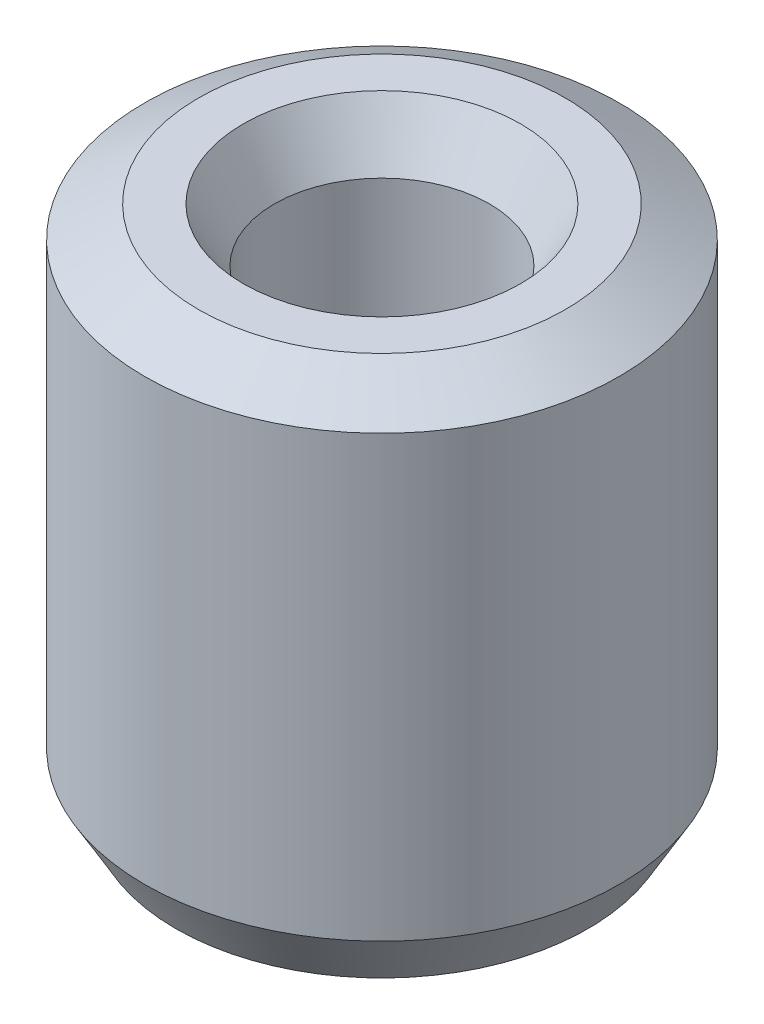
ISO-10303-21;
HEADER;
FILE_DESCRIPTION(('STEP AP214'),'2;1');
FILE_NAME('part.step','',(''),(''),'','','');
FILE_SCHEMA(('AUTOMOTIVE_DESIGN { 1 0 10303 214 1 1 1 1 }'));
ENDSEC;
DATA;
#1=APPLICATION_CONTEXT('core data for automotive mechanical design processes');
#2=APPLICATION_PROTOCOL_DEFINITION('international standard','automotive_design',2000,#1);
#3=PRODUCT_CONTEXT('',#1,'mechanical');
#4=PRODUCT('Part','Part','',(#3));
#5=PRODUCT_RELATED_PRODUCT_CATEGORY('part','',(#4));
#6=PRODUCT_DEFINITION_FORMATION('','',#4);
#7=PRODUCT_DEFINITION_CONTEXT('part definition',#1,'design');
#8=PRODUCT_DEFINITION('design','',#6,#7);
#9=PRODUCT_DEFINITION_SHAPE('','',#8);
#10=(LENGTH_UNIT() NAMED_UNIT(*) SI_UNIT(.MILLI.,.METRE.));
#11=(NAMED_UNIT(*) PLANE_ANGLE_UNIT() SI_UNIT($,.RADIAN.));
#12=(NAMED_UNIT(*) SI_UNIT($,.STERADIAN.) SOLID_ANGLE_UNIT());
#13=UNCERTAINTY_MEASURE_WITH_UNIT(LENGTH_MEASURE(1.E-05),#10,'distance_accuracy_value','');
#14=(GEOMETRIC_REPRESENTATION_CONTEXT(3) GLOBAL_UNCERTAINTY_ASSIGNED_CONTEXT((#13)) GLOBAL_UNIT_ASSIGNED_CONTEXT((#10,
#11,#12)) REPRESENTATION_CONTEXT('',''));
#15=CARTESIAN_POINT('',(0.,0.,0.));
#16=DIRECTION('',(0.,0.,1.));
#17=DIRECTION('',(1.,0.,0.));
#18=AXIS2_PLACEMENT_3D('',#15,#16,#17);
#19=CARTESIAN_POINT('',(0.,16.5951194026699,0.));
#20=DIRECTION('',(0.,-1.,0.));
#21=DIRECTION('',(0.,0.,-1.));
#22=AXIS2_PLACEMENT_3D('',#19,#20,#21);
#23=CYLINDRICAL_SURFACE('',#22,7.5);
#24=CARTESIAN_POINT('',(0.,1.70152879116408,0.));
#25=DIRECTION('',(0.,1.,0.));
#26=DIRECTION('',(0.,0.,1.));
#27=AXIS2_PLACEMENT_3D('',#24,#25,#26);
#28=CIRCLE('',#27,7.5);
#29=CARTESIAN_POINT('',(0.,1.70152879116408,7.5));
#30=VERTEX_POINT('',#29);
#31=EDGE_CURVE('E10',#30,#30,#28,.T.);
#32=ORIENTED_EDGE('',*,*,#31,.T.);
#33=EDGE_LOOP('',(#32));
#34=FACE_BOUND('',#33,.T.);
#35=CARTESIAN_POINT('',(0.,15.6127412970575,0.));
#36=DIRECTION('',(0.,1.,0.));
#37=DIRECTION('',(0.,0.,1.));
#38=AXIS2_PLACEMENT_3D('',#35,#36,#37);
#39=CIRCLE('',#38,7.5);
#40=CARTESIAN_POINT('',(0.,15.6127412970575,7.5));
#41=VERTEX_POINT('',#40);
#42=EDGE_CURVE('E50',#41,#41,#39,.F.);
#43=ORIENTED_EDGE('',*,*,#42,.T.);
#44=EDGE_LOOP('',(#43));
#45=FACE_BOUND('',#44,.T.);
#46=ADVANCED_FACE('F39',(#34,#45),#23,.T.);
#47=CARTESIAN_POINT('',(0.,16.5951194026699,0.));
#48=DIRECTION('',(0.,1.,0.));
#49=DIRECTION('',(0.,0.,1.));
#50=AXIS2_PLACEMENT_3D('',#47,#48,#49);
#51=PLANE('',#50);
#52=CARTESIAN_POINT('',(0.,16.5951194026699,0.));
#53=DIRECTION('',(0.,1.,0.));
#54=DIRECTION('',(0.,0.,1.));
#55=AXIS2_PLACEMENT_3D('',#52,#53,#54);
#56=CIRCLE('',#55,4.38241865529047);
#57=CARTESIAN_POINT('',(0.,16.5951194026699,4.38241865529047));
#58=VERTEX_POINT('',#57);
#59=EDGE_CURVE('E58',#58,#58,#56,.F.);
#60=ORIENTED_EDGE('',*,*,#59,.T.);
#61=EDGE_LOOP('',(#60));
#62=FACE_BOUND('',#61,.T.);
#63=CARTESIAN_POINT('',(0.,16.5951194026699,0.));
#64=DIRECTION('',(0.,1.,0.));
#65=DIRECTION('',(0.,0.,1.));
#66=AXIS2_PLACEMENT_3D('',#63,#64,#65);
#67=CIRCLE('',#66,5.79847120883593);
#68=CARTESIAN_POINT('',(0.,16.5951194026699,5.79847120883593));
#69=VERTEX_POINT('',#68);
#70=EDGE_CURVE('E61',#69,#69,#67,.T.);
#71=ORIENTED_EDGE('',*,*,#70,.T.);
#72=EDGE_LOOP('',(#71));
#73=FACE_BOUND('',#72,.T.);
#74=ADVANCED_FACE('F88',(#62,#73),#51,.T.);
#75=CARTESIAN_POINT('',(0.,0.,0.));
#76=DIRECTION('',(0.,1.,0.));
#77=DIRECTION('',(0.,0.,1.));
#78=AXIS2_PLACEMENT_3D('',#75,#76,#77);
#79=PLANE('',#78);
#80=CARTESIAN_POINT('',(0.,0.,0.));
#81=DIRECTION('',(0.,1.,0.));
#82=DIRECTION('',(0.,0.,1.));
#83=AXIS2_PLACEMENT_3D('',#80,#81,#82);
#84=CIRCLE('',#83,5.10156934084205);
#85=CARTESIAN_POINT('',(0.,0.,5.10156934084205));
#86=VERTEX_POINT('',#85);
#87=EDGE_CURVE('E51',#86,#86,#84,.T.);
#88=ORIENTED_EDGE('',*,*,#87,.T.);
#89=EDGE_LOOP('',(#88));
#90=FACE_BOUND('',#89,.T.);
#91=CARTESIAN_POINT('',(0.,0.,0.));
#92=DIRECTION('',(0.,1.,0.));
#93=DIRECTION('',(0.,0.,1.));
#94=AXIS2_PLACEMENT_3D('',#91,#92,#93);
#95=CIRCLE('',#94,6.51762189438751);
#96=CARTESIAN_POINT('',(0.,0.,6.51762189438751));
#97=VERTEX_POINT('',#96);
#98=EDGE_CURVE('E54',#97,#97,#95,.F.);
#99=ORIENTED_EDGE('',*,*,#98,.T.);
#100=EDGE_LOOP('',(#99));
#101=FACE_BOUND('',#100,.T.);
#102=ADVANCED_FACE('F83',(#90,#101),#79,.F.);
#103=CARTESIAN_POINT('',(0.,16.5951194026699,0.));
#104=DIRECTION('',(0.,-1.,0.));
#105=DIRECTION('',(0.,0.,-1.));
#106=AXIS2_PLACEMENT_3D('',#103,#104,#105);
#107=CYLINDRICAL_SURFACE('',#106,3.40004054967798);
#108=CARTESIAN_POINT('',(0.,14.8935906115059,0.));
#109=DIRECTION('',(0.,1.,0.));
#110=DIRECTION('',(0.,0.,1.));
#111=AXIS2_PLACEMENT_3D('',#108,#109,#110);
#112=CIRCLE('',#111,3.40004054967798);
#113=CARTESIAN_POINT('',(0.,14.8935906115059,3.40004054967798));
#114=VERTEX_POINT('',#113);
#115=EDGE_CURVE('E67',#114,#114,#112,.T.);
#116=ORIENTED_EDGE('',*,*,#115,.T.);
#117=EDGE_LOOP('',(#116));
#118=FACE_BOUND('',#117,.T.);
#119=CARTESIAN_POINT('',(0.,0.982378105612483,0.));
#120=DIRECTION('',(0.,1.,0.));
#121=DIRECTION('',(0.,0.,1.));
#122=AXIS2_PLACEMENT_3D('',#119,#120,#121);
#123=CIRCLE('',#122,3.40004054967798);
#124=CARTESIAN_POINT('',(0.,0.982378105612483,3.40004054967798));
#125=VERTEX_POINT('',#124);
#126=EDGE_CURVE('E69',#125,#125,#123,.F.);
#127=ORIENTED_EDGE('',*,*,#126,.T.);
#128=EDGE_LOOP('',(#127));
#129=FACE_BOUND('',#128,.T.);
#130=ADVANCED_FACE('F71',(#118,#129),#107,.F.);
#131=CARTESIAN_POINT('',(0.,14.8935906115059,0.));
#132=DIRECTION('',(0.,1.,0.));
#133=DIRECTION('',(0.,0.,1.));
#134=AXIS2_PLACEMENT_3D('',#131,#132,#133);
#135=CONICAL_SURFACE('',#134,3.40004054967798,0.523598775598303);
#136=ORIENTED_EDGE('',*,*,#59,.F.);
#137=EDGE_LOOP('',(#136));
#138=FACE_BOUND('',#137,.T.);
#139=ORIENTED_EDGE('',*,*,#115,.F.);
#140=EDGE_LOOP('',(#139));
#141=FACE_BOUND('',#140,.T.);
#142=ADVANCED_FACE('F77',(#138,#141),#135,.F.);
#143=CARTESIAN_POINT('',(0.,0.,0.));
#144=DIRECTION('',(0.,-1.,0.));
#145=DIRECTION('',(0.,0.,-1.));
#146=AXIS2_PLACEMENT_3D('',#143,#144,#145);
#147=CONICAL_SURFACE('',#146,5.10156934084205,1.04719755119659);
#148=ORIENTED_EDGE('',*,*,#126,.F.);
#149=EDGE_LOOP('',(#148));
#150=FACE_BOUND('',#149,.T.);
#151=ORIENTED_EDGE('',*,*,#87,.F.);
#152=EDGE_LOOP('',(#151));
#153=FACE_BOUND('',#152,.T.);
#154=ADVANCED_FACE('F73',(#150,#153),#147,.F.);
#155=CARTESIAN_POINT('',(0.,1.70152879116408,0.));
#156=DIRECTION('',(0.,1.,0.));
#157=DIRECTION('',(0.,0.,1.));
#158=AXIS2_PLACEMENT_3D('',#155,#156,#157);
#159=CONICAL_SURFACE('',#158,7.5,0.523598775598303);
#160=ORIENTED_EDGE('',*,*,#98,.F.);
#161=EDGE_LOOP('',(#160));
#162=FACE_BOUND('',#161,.T.);
#163=ORIENTED_EDGE('',*,*,#31,.F.);
#164=EDGE_LOOP('',(#163));
#165=FACE_BOUND('',#164,.T.);
#166=ADVANCED_FACE('F76',(#162,#165),#159,.T.);
#167=CARTESIAN_POINT('',(0.,16.5951194026699,0.));
#168=DIRECTION('',(0.,-1.,0.));
#169=DIRECTION('',(0.,0.,-1.));
#170=AXIS2_PLACEMENT_3D('',#167,#168,#169);
#171=CONICAL_SURFACE('',#170,5.79847120883593,1.04719755119659);
#172=ORIENTED_EDGE('',*,*,#42,.F.);
#173=EDGE_LOOP('',(#172));
#174=FACE_BOUND('',#173,.T.);
#175=ORIENTED_EDGE('',*,*,#70,.F.);
#176=EDGE_LOOP('',(#175));
#177=FACE_BOUND('',#176,.T.);
#178=ADVANCED_FACE('F45',(#174,#177),#171,.T.);
#179=CLOSED_SHELL('',(#46,#74,#102,#130,#142,#154,#166,#178));
#180=MANIFOLD_SOLID_BREP('B2',#179);
#181=ADVANCED_BREP_SHAPE_REPRESENTATION('',(#18,#180),#14);
#182=SHAPE_DEFINITION_REPRESENTATION(#9,#181);
ENDSEC;
END-ISO-10303-21;
